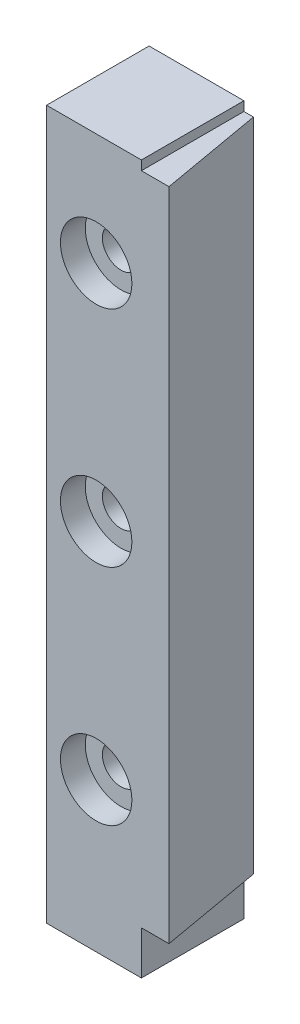
ISO-10303-21;
HEADER;
FILE_DESCRIPTION(('STEP AP214'),'2;1');
FILE_NAME('part.step','',(''),(''),'','','');
FILE_SCHEMA(('AUTOMOTIVE_DESIGN { 1 0 10303 214 1 1 1 1 }'));
ENDSEC;
DATA;
#1=APPLICATION_CONTEXT('core data for automotive mechanical design processes');
#2=APPLICATION_PROTOCOL_DEFINITION('international standard','automotive_design',2000,#1);
#3=PRODUCT_CONTEXT('',#1,'mechanical');
#4=PRODUCT('Part','Part','',(#3));
#5=PRODUCT_RELATED_PRODUCT_CATEGORY('part','',(#4));
#6=PRODUCT_DEFINITION_FORMATION('','',#4);
#7=PRODUCT_DEFINITION_CONTEXT('part definition',#1,'design');
#8=PRODUCT_DEFINITION('design','',#6,#7);
#9=PRODUCT_DEFINITION_SHAPE('','',#8);
#10=(LENGTH_UNIT() NAMED_UNIT(*) SI_UNIT(.MILLI.,.METRE.));
#11=(NAMED_UNIT(*) PLANE_ANGLE_UNIT() SI_UNIT($,.RADIAN.));
#12=(NAMED_UNIT(*) SI_UNIT($,.STERADIAN.) SOLID_ANGLE_UNIT());
#13=UNCERTAINTY_MEASURE_WITH_UNIT(LENGTH_MEASURE(1.E-05),#10,'distance_accuracy_value','');
#14=(GEOMETRIC_REPRESENTATION_CONTEXT(3) GLOBAL_UNCERTAINTY_ASSIGNED_CONTEXT((#13)) GLOBAL_UNIT_ASSIGNED_CONTEXT((#10,
#11,#12)) REPRESENTATION_CONTEXT('',''));
#15=CARTESIAN_POINT('',(0.,0.,0.));
#16=DIRECTION('',(0.,0.,1.));
#17=DIRECTION('',(1.,0.,0.));
#18=AXIS2_PLACEMENT_3D('',#15,#16,#17);
#19=CARTESIAN_POINT('',(-10.87,0.,-58.2584072114678));
#20=DIRECTION('',(1.,0.,0.));
#21=DIRECTION('',(0.,0.,-1.));
#22=AXIS2_PLACEMENT_3D('',#19,#20,#21);
#23=PLANE('',#22);
#24=DIRECTION('',(0.,1.,0.));
#25=VECTOR('',#24,1.);
#26=CARTESIAN_POINT('',(-10.87,0.,9.));
#27=LINE('',#26,#25);
#28=CARTESIAN_POINT('',(-10.87,56.25,9.));
#29=VERTEX_POINT('',#28);
#30=CARTESIAN_POINT('',(-10.87,57.,9.));
#31=VERTEX_POINT('',#30);
#32=EDGE_CURVE('E164',#29,#31,#27,.T.);
#33=ORIENTED_EDGE('',*,*,#32,.F.);
#34=DIRECTION('',(0.,0.,-1.));
#35=VECTOR('',#34,1.);
#36=CARTESIAN_POINT('',(-10.87,56.25,0.750000000000034));
#37=LINE('',#36,#35);
#38=CARTESIAN_POINT('',(-10.87,56.25,0.750000000000001));
#39=VERTEX_POINT('',#38);
#40=EDGE_CURVE('E165',#29,#39,#37,.T.);
#41=ORIENTED_EDGE('',*,*,#40,.T.);
#42=DIRECTION('',(0.,-1.,0.));
#43=VECTOR('',#42,1.);
#44=CARTESIAN_POINT('',(-10.87,0.,0.750000000000001));
#45=LINE('',#44,#43);
#46=CARTESIAN_POINT('',(-10.87,57.,0.750000000000001));
#47=VERTEX_POINT('',#46);
#48=EDGE_CURVE('E40',#47,#39,#45,.T.);
#49=ORIENTED_EDGE('',*,*,#48,.F.);
#50=DIRECTION('',(0.,0.,1.));
#51=VECTOR('',#50,1.);
#52=CARTESIAN_POINT('',(-10.87,57.,-58.2584072114678));
#53=LINE('',#52,#51);
#54=EDGE_CURVE('E149',#47,#31,#53,.T.);
#55=ORIENTED_EDGE('',*,*,#54,.T.);
#56=EDGE_LOOP('',(#33,#41,#49,#55));
#57=FACE_BOUND('',#56,.T.);
#58=ADVANCED_FACE('F32',(#57),#23,.T.);
#59=CARTESIAN_POINT('',(-10.87,3.5,0.750000000000001));
#60=VERTEX_POINT('',#59);
#61=CARTESIAN_POINT('',(-10.87,0.,0.750000000000001));
#62=VERTEX_POINT('',#61);
#63=EDGE_CURVE('E66',#60,#62,#45,.T.);
#64=ORIENTED_EDGE('',*,*,#63,.F.);
#65=DIRECTION('',(0.,0.,1.));
#66=VECTOR('',#65,1.);
#67=CARTESIAN_POINT('',(-10.87,3.5,0.750000000000001));
#68=LINE('',#67,#66);
#69=CARTESIAN_POINT('',(-10.87,3.5,9.));
#70=VERTEX_POINT('',#69);
#71=EDGE_CURVE('E126',#60,#70,#68,.T.);
#72=ORIENTED_EDGE('',*,*,#71,.T.);
#73=CARTESIAN_POINT('',(-10.87,0.,9.));
#74=VERTEX_POINT('',#73);
#75=EDGE_CURVE('E125',#74,#70,#27,.T.);
#76=ORIENTED_EDGE('',*,*,#75,.F.);
#77=DIRECTION('',(0.,0.,1.));
#78=VECTOR('',#77,1.);
#79=CARTESIAN_POINT('',(-10.87,0.,-58.2584072114678));
#80=LINE('',#79,#78);
#81=EDGE_CURVE('E77',#62,#74,#80,.T.);
#82=ORIENTED_EDGE('',*,*,#81,.F.);
#83=EDGE_LOOP('',(#64,#72,#76,#82));
#84=FACE_BOUND('',#83,.T.);
#85=ADVANCED_FACE('F251',(#84),#23,.T.);
#86=CARTESIAN_POINT('',(-18.5,0.,-58.2584072114678));
#87=DIRECTION('',(0.,-1.,0.));
#88=DIRECTION('',(1.,0.,0.));
#89=AXIS2_PLACEMENT_3D('',#86,#87,#88);
#90=PLANE('',#89);
#91=DIRECTION('',(-1.,0.,0.));
#92=VECTOR('',#91,1.);
#93=CARTESIAN_POINT('',(-18.5,0.,0.750000000000001));
#94=LINE('',#93,#92);
#95=CARTESIAN_POINT('',(-18.5,0.,0.750000000000001));
#96=VERTEX_POINT('',#95);
#97=EDGE_CURVE('E138',#62,#96,#94,.T.);
#98=ORIENTED_EDGE('',*,*,#97,.F.);
#99=ORIENTED_EDGE('',*,*,#81,.T.);
#100=DIRECTION('',(1.,0.,0.));
#101=VECTOR('',#100,1.);
#102=CARTESIAN_POINT('',(-18.5,0.,9.));
#103=LINE('',#102,#101);
#104=CARTESIAN_POINT('',(-18.5,0.,9.));
#105=VERTEX_POINT('',#104);
#106=EDGE_CURVE('E153',#105,#74,#103,.T.);
#107=ORIENTED_EDGE('',*,*,#106,.F.);
#108=DIRECTION('',(0.,0.,1.));
#109=VECTOR('',#108,1.);
#110=CARTESIAN_POINT('',(-18.5,0.,-58.2584072114678));
#111=LINE('',#110,#109);
#112=EDGE_CURVE('E155',#96,#105,#111,.T.);
#113=ORIENTED_EDGE('',*,*,#112,.F.);
#114=EDGE_LOOP('',(#98,#99,#107,#113));
#115=FACE_BOUND('',#114,.T.);
#116=ADVANCED_FACE('F256',(#115),#90,.T.);
#117=CARTESIAN_POINT('',(-18.5,57.,-58.2584072114678));
#118=DIRECTION('',(-1.,0.,0.));
#119=DIRECTION('',(0.,-1.,0.));
#120=AXIS2_PLACEMENT_3D('',#117,#118,#119);
#121=PLANE('',#120);
#122=DIRECTION('',(0.,1.,0.));
#123=VECTOR('',#122,1.);
#124=CARTESIAN_POINT('',(-18.5,57.,0.750000000000001));
#125=LINE('',#124,#123);
#126=CARTESIAN_POINT('',(-18.5,57.,0.750000000000001));
#127=VERTEX_POINT('',#126);
#128=EDGE_CURVE('E70',#96,#127,#125,.T.);
#129=ORIENTED_EDGE('',*,*,#128,.F.);
#130=ORIENTED_EDGE('',*,*,#112,.T.);
#131=DIRECTION('',(0.,-1.,0.));
#132=VECTOR('',#131,1.);
#133=CARTESIAN_POINT('',(-18.5,57.,9.));
#134=LINE('',#133,#132);
#135=CARTESIAN_POINT('',(-18.5,57.,9.));
#136=VERTEX_POINT('',#135);
#137=EDGE_CURVE('E159',#136,#105,#134,.T.);
#138=ORIENTED_EDGE('',*,*,#137,.F.);
#139=DIRECTION('',(0.,0.,1.));
#140=VECTOR('',#139,1.);
#141=CARTESIAN_POINT('',(-18.5,57.,-58.2584072114678));
#142=LINE('',#141,#140);
#143=EDGE_CURVE('E152',#127,#136,#142,.T.);
#144=ORIENTED_EDGE('',*,*,#143,.F.);
#145=EDGE_LOOP('',(#129,#130,#138,#144));
#146=FACE_BOUND('',#145,.T.);
#147=ADVANCED_FACE('F245',(#146),#121,.T.);
#148=CARTESIAN_POINT('',(-10.87,57.,-58.2584072114678));
#149=DIRECTION('',(0.,1.,0.));
#150=DIRECTION('',(-1.,0.,0.));
#151=AXIS2_PLACEMENT_3D('',#148,#149,#150);
#152=PLANE('',#151);
#153=DIRECTION('',(1.,0.,0.));
#154=VECTOR('',#153,1.);
#155=CARTESIAN_POINT('',(-10.87,57.,0.750000000000001));
#156=LINE('',#155,#154);
#157=EDGE_CURVE('E11',#127,#47,#156,.T.);
#158=ORIENTED_EDGE('',*,*,#157,.F.);
#159=ORIENTED_EDGE('',*,*,#143,.T.);
#160=DIRECTION('',(-1.,0.,0.));
#161=VECTOR('',#160,1.);
#162=CARTESIAN_POINT('',(-10.87,57.,9.));
#163=LINE('',#162,#161);
#164=EDGE_CURVE('E161',#31,#136,#163,.T.);
#165=ORIENTED_EDGE('',*,*,#164,.F.);
#166=ORIENTED_EDGE('',*,*,#54,.F.);
#167=EDGE_LOOP('',(#158,#159,#165,#166));
#168=FACE_BOUND('',#167,.T.);
#169=ADVANCED_FACE('F237',(#168),#152,.T.);
#170=CARTESIAN_POINT('',(0.,0.,9.));
#171=DIRECTION('',(0.,0.,1.));
#172=DIRECTION('',(1.,0.,0.));
#173=AXIS2_PLACEMENT_3D('',#170,#171,#172);
#174=PLANE('',#173);
#175=CARTESIAN_POINT('',(-14.5102999843588,30.,9.));
#176=DIRECTION('',(0.,0.,1.));
#177=DIRECTION('',(1.,0.,0.));
#178=AXIS2_PLACEMENT_3D('',#175,#176,#177);
#179=CIRCLE('',#178,2.875);
#180=CARTESIAN_POINT('',(-11.6352999843588,30.,9.));
#181=VERTEX_POINT('',#180);
#182=EDGE_CURVE('E197',#181,#181,#179,.T.);
#183=ORIENTED_EDGE('',*,*,#182,.F.);
#184=EDGE_LOOP('',(#183));
#185=FACE_BOUND('',#184,.T.);
#186=CARTESIAN_POINT('',(-14.5102999843588,48.,9.));
#187=DIRECTION('',(0.,0.,1.));
#188=DIRECTION('',(1.,0.,0.));
#189=AXIS2_PLACEMENT_3D('',#186,#187,#188);
#190=CIRCLE('',#189,2.875);
#191=CARTESIAN_POINT('',(-11.6352999843588,48.,9.));
#192=VERTEX_POINT('',#191);
#193=EDGE_CURVE('E191',#192,#192,#190,.T.);
#194=ORIENTED_EDGE('',*,*,#193,.F.);
#195=EDGE_LOOP('',(#194));
#196=FACE_BOUND('',#195,.T.);
#197=CARTESIAN_POINT('',(-14.5102999843588,12.,9.));
#198=DIRECTION('',(0.,0.,1.));
#199=DIRECTION('',(1.,0.,0.));
#200=AXIS2_PLACEMENT_3D('',#197,#198,#199);
#201=CIRCLE('',#200,2.875);
#202=CARTESIAN_POINT('',(-11.6352999843588,12.,9.));
#203=VERTEX_POINT('',#202);
#204=EDGE_CURVE('E185',#203,#203,#201,.T.);
#205=ORIENTED_EDGE('',*,*,#204,.F.);
#206=EDGE_LOOP('',(#205));
#207=FACE_BOUND('',#206,.T.);
#208=ORIENTED_EDGE('',*,*,#75,.T.);
#209=DIRECTION('',(1.,0.,0.));
#210=VECTOR('',#209,1.);
#211=CARTESIAN_POINT('',(-10.87,3.5,9.));
#212=LINE('',#211,#210);
#213=CARTESIAN_POINT('',(-8.65081193809254,3.5,9.));
#214=VERTEX_POINT('',#213);
#215=EDGE_CURVE('E48',#70,#214,#212,.T.);
#216=ORIENTED_EDGE('',*,*,#215,.T.);
#217=DIRECTION('',(0.,-1.,0.));
#218=VECTOR('',#217,1.);
#219=CARTESIAN_POINT('',(-8.65081193809254,64.7932602473595,9.));
#220=LINE('',#219,#218);
#221=CARTESIAN_POINT('',(-8.65081193809254,56.25,9.));
#222=VERTEX_POINT('',#221);
#223=EDGE_CURVE('E111',#222,#214,#220,.T.);
#224=ORIENTED_EDGE('',*,*,#223,.F.);
#225=DIRECTION('',(-1.,0.,0.));
#226=VECTOR('',#225,1.);
#227=CARTESIAN_POINT('',(-10.87,56.25,9.));
#228=LINE('',#227,#226);
#229=EDGE_CURVE('E180',#222,#29,#228,.T.);
#230=ORIENTED_EDGE('',*,*,#229,.T.);
#231=ORIENTED_EDGE('',*,*,#32,.T.);
#232=ORIENTED_EDGE('',*,*,#164,.T.);
#233=ORIENTED_EDGE('',*,*,#137,.T.);
#234=ORIENTED_EDGE('',*,*,#106,.T.);
#235=EDGE_LOOP('',(#208,#216,#224,#230,#231,#232,#233,#234));
#236=FACE_BOUND('',#235,.T.);
#237=ADVANCED_FACE('F123',(#185,#196,#207,#236),#174,.T.);
#238=CARTESIAN_POINT('',(-58.,100.,0.749999999999999));
#239=DIRECTION('',(0.,0.,1.));
#240=DIRECTION('',(1.,0.,0.));
#241=AXIS2_PLACEMENT_3D('',#238,#239,#240);
#242=PLANE('',#241);
#243=CARTESIAN_POINT('',(-14.5102999843588,12.,0.750000000000001));
#244=DIRECTION('',(0.,0.,1.));
#245=DIRECTION('',(1.,0.,0.));
#246=AXIS2_PLACEMENT_3D('',#243,#244,#245);
#247=CIRCLE('',#246,1.5);
#248=CARTESIAN_POINT('',(-13.0102999843588,12.,0.750000000000001));
#249=VERTEX_POINT('',#248);
#250=EDGE_CURVE('E210',#249,#249,#247,.T.);
#251=ORIENTED_EDGE('',*,*,#250,.T.);
#252=EDGE_LOOP('',(#251));
#253=FACE_BOUND('',#252,.T.);
#254=CARTESIAN_POINT('',(-14.5102999843588,30.,0.750000000000001));
#255=DIRECTION('',(0.,0.,1.));
#256=DIRECTION('',(1.,0.,0.));
#257=AXIS2_PLACEMENT_3D('',#254,#255,#256);
#258=CIRCLE('',#257,1.5);
#259=CARTESIAN_POINT('',(-13.0102999843588,30.,0.750000000000001));
#260=VERTEX_POINT('',#259);
#261=EDGE_CURVE('E206',#260,#260,#258,.T.);
#262=ORIENTED_EDGE('',*,*,#261,.T.);
#263=EDGE_LOOP('',(#262));
#264=FACE_BOUND('',#263,.T.);
#265=CARTESIAN_POINT('',(-14.5102999843588,48.,0.750000000000001));
#266=DIRECTION('',(0.,0.,1.));
#267=DIRECTION('',(1.,0.,0.));
#268=AXIS2_PLACEMENT_3D('',#265,#266,#267);
#269=CIRCLE('',#268,1.5);
#270=CARTESIAN_POINT('',(-13.0102999843588,48.,0.750000000000001));
#271=VERTEX_POINT('',#270);
#272=EDGE_CURVE('E200',#271,#271,#269,.T.);
#273=ORIENTED_EDGE('',*,*,#272,.T.);
#274=EDGE_LOOP('',(#273));
#275=FACE_BOUND('',#274,.T.);
#276=ORIENTED_EDGE('',*,*,#48,.T.);
#277=DIRECTION('',(1.,0.,0.));
#278=VECTOR('',#277,1.);
#279=CARTESIAN_POINT('',(-10.1055095289373,56.25,0.750000000000001));
#280=LINE('',#279,#278);
#281=CARTESIAN_POINT('',(-10.1055095289373,56.25,0.750000000000001));
#282=VERTEX_POINT('',#281);
#283=EDGE_CURVE('E119',#39,#282,#280,.T.);
#284=ORIENTED_EDGE('',*,*,#283,.T.);
#285=DIRECTION('',(0.,-1.,0.));
#286=VECTOR('',#285,1.);
#287=CARTESIAN_POINT('',(-10.1055095289373,64.7932602473595,0.750000000000001));
#288=LINE('',#287,#286);
#289=CARTESIAN_POINT('',(-10.1055095289373,3.5,0.750000000000001));
#290=VERTEX_POINT('',#289);
#291=EDGE_CURVE('E120',#282,#290,#288,.T.);
#292=ORIENTED_EDGE('',*,*,#291,.T.);
#293=DIRECTION('',(-1.,0.,0.));
#294=VECTOR('',#293,1.);
#295=CARTESIAN_POINT('',(-10.1055095289373,3.5,0.750000000000001));
#296=LINE('',#295,#294);
#297=EDGE_CURVE('E129',#290,#60,#296,.T.);
#298=ORIENTED_EDGE('',*,*,#297,.T.);
#299=ORIENTED_EDGE('',*,*,#63,.T.);
#300=ORIENTED_EDGE('',*,*,#97,.T.);
#301=ORIENTED_EDGE('',*,*,#128,.T.);
#302=ORIENTED_EDGE('',*,*,#157,.T.);
#303=EDGE_LOOP('',(#276,#284,#292,#298,#299,#300,#301,#302));
#304=FACE_BOUND('',#303,.T.);
#305=ADVANCED_FACE('F236',(#253,#264,#275,#304),#242,.F.);
#306=CARTESIAN_POINT('',(0.,3.5,0.));
#307=DIRECTION('',(0.,1.,0.));
#308=DIRECTION('',(0.,0.,1.));
#309=AXIS2_PLACEMENT_3D('',#306,#307,#308);
#310=PLANE('',#309);
#311=ORIENTED_EDGE('',*,*,#71,.F.);
#312=ORIENTED_EDGE('',*,*,#297,.F.);
#313=DIRECTION('',(-0.173648177666924,0.,-0.984807753012209));
#314=VECTOR('',#313,1.);
#315=CARTESIAN_POINT('',(-8.65081193809254,3.5,9.));
#316=LINE('',#315,#314);
#317=EDGE_CURVE('E114',#214,#290,#316,.T.);
#318=ORIENTED_EDGE('',*,*,#317,.F.);
#319=ORIENTED_EDGE('',*,*,#215,.F.);
#320=EDGE_LOOP('',(#311,#312,#318,#319));
#321=FACE_BOUND('',#320,.T.);
#322=ADVANCED_FACE('F128',(#321),#310,.F.);
#323=CARTESIAN_POINT('',(-8.65081193809254,64.7932602473595,9.));
#324=DIRECTION('',(-0.984807753012209,0.,0.173648177666924));
#325=DIRECTION('',(0.173648177666924,0.,0.984807753012209));
#326=AXIS2_PLACEMENT_3D('',#323,#324,#325);
#327=PLANE('',#326);
#328=ORIENTED_EDGE('',*,*,#291,.F.);
#329=DIRECTION('',(0.173648177666924,0.,0.984807753012209));
#330=VECTOR('',#329,1.);
#331=CARTESIAN_POINT('',(-8.65081193809253,56.25,9.00000000000003));
#332=LINE('',#331,#330);
#333=EDGE_CURVE('E116',#282,#222,#332,.T.);
#334=ORIENTED_EDGE('',*,*,#333,.T.);
#335=ORIENTED_EDGE('',*,*,#223,.T.);
#336=ORIENTED_EDGE('',*,*,#317,.T.);
#337=EDGE_LOOP('',(#328,#334,#335,#336));
#338=FACE_BOUND('',#337,.T.);
#339=ADVANCED_FACE('F113',(#338),#327,.F.);
#340=CARTESIAN_POINT('',(-65.243149171521,56.25,-3.99999999999997));
#341=DIRECTION('',(0.,-1.,0.));
#342=DIRECTION('',(0.,0.,-1.));
#343=AXIS2_PLACEMENT_3D('',#340,#341,#342);
#344=PLANE('',#343);
#345=ORIENTED_EDGE('',*,*,#229,.F.);
#346=ORIENTED_EDGE('',*,*,#333,.F.);
#347=ORIENTED_EDGE('',*,*,#283,.F.);
#348=ORIENTED_EDGE('',*,*,#40,.F.);
#349=EDGE_LOOP('',(#345,#346,#347,#348));
#350=FACE_BOUND('',#349,.T.);
#351=ADVANCED_FACE('F231',(#350),#344,.F.);
#352=CARTESIAN_POINT('',(-14.5102999843588,12.,7.));
#353=DIRECTION('',(0.,0.,1.));
#354=DIRECTION('',(1.,0.,0.));
#355=AXIS2_PLACEMENT_3D('',#352,#353,#354);
#356=CYLINDRICAL_SURFACE('',#355,2.875);
#357=CARTESIAN_POINT('',(-14.5102999843588,12.,7.));
#358=DIRECTION('',(0.,0.,1.));
#359=DIRECTION('',(1.,0.,0.));
#360=AXIS2_PLACEMENT_3D('',#357,#358,#359);
#361=CIRCLE('',#360,2.875);
#362=CARTESIAN_POINT('',(-11.6352999843588,12.,7.));
#363=VERTEX_POINT('',#362);
#364=EDGE_CURVE('E168',#363,#363,#361,.T.);
#365=ORIENTED_EDGE('',*,*,#364,.F.);
#366=EDGE_LOOP('',(#365));
#367=FACE_BOUND('',#366,.T.);
#368=ORIENTED_EDGE('',*,*,#204,.T.);
#369=EDGE_LOOP('',(#368));
#370=FACE_BOUND('',#369,.T.);
#371=ADVANCED_FACE('F225',(#367,#370),#356,.F.);
#372=CARTESIAN_POINT('',(-14.5102999843588,12.,7.));
#373=DIRECTION('',(0.,0.,1.));
#374=DIRECTION('',(1.,0.,0.));
#375=AXIS2_PLACEMENT_3D('',#372,#373,#374);
#376=PLANE('',#375);
#377=CARTESIAN_POINT('',(-14.5102999843588,12.,7.));
#378=DIRECTION('',(0.,0.,1.));
#379=DIRECTION('',(1.,0.,0.));
#380=AXIS2_PLACEMENT_3D('',#377,#378,#379);
#381=CIRCLE('',#380,1.5);
#382=CARTESIAN_POINT('',(-13.0102999843588,12.,7.));
#383=VERTEX_POINT('',#382);
#384=EDGE_CURVE('E35',#383,#383,#381,.T.);
#385=ORIENTED_EDGE('',*,*,#384,.F.);
#386=EDGE_LOOP('',(#385));
#387=FACE_BOUND('',#386,.T.);
#388=ORIENTED_EDGE('',*,*,#364,.T.);
#389=EDGE_LOOP('',(#388));
#390=FACE_BOUND('',#389,.T.);
#391=ADVANCED_FACE('F221',(#387,#390),#376,.T.);
#392=CARTESIAN_POINT('',(-14.5102999843588,48.,7.));
#393=DIRECTION('',(0.,0.,1.));
#394=DIRECTION('',(1.,0.,0.));
#395=AXIS2_PLACEMENT_3D('',#392,#393,#394);
#396=CYLINDRICAL_SURFACE('',#395,2.875);
#397=CARTESIAN_POINT('',(-14.5102999843588,48.,7.));
#398=DIRECTION('',(0.,0.,1.));
#399=DIRECTION('',(1.,0.,0.));
#400=AXIS2_PLACEMENT_3D('',#397,#398,#399);
#401=CIRCLE('',#400,2.875);
#402=CARTESIAN_POINT('',(-11.6352999843588,48.,7.));
#403=VERTEX_POINT('',#402);
#404=EDGE_CURVE('E188',#403,#403,#401,.T.);
#405=ORIENTED_EDGE('',*,*,#404,.F.);
#406=EDGE_LOOP('',(#405));
#407=FACE_BOUND('',#406,.T.);
#408=ORIENTED_EDGE('',*,*,#193,.T.);
#409=EDGE_LOOP('',(#408));
#410=FACE_BOUND('',#409,.T.);
#411=ADVANCED_FACE('F224',(#407,#410),#396,.F.);
#412=CARTESIAN_POINT('',(-14.5102999843588,48.,7.));
#413=DIRECTION('',(0.,0.,1.));
#414=DIRECTION('',(1.,0.,0.));
#415=AXIS2_PLACEMENT_3D('',#412,#413,#414);
#416=PLANE('',#415);
#417=CARTESIAN_POINT('',(-14.5102999843588,48.,7.));
#418=DIRECTION('',(0.,0.,1.));
#419=DIRECTION('',(1.,0.,0.));
#420=AXIS2_PLACEMENT_3D('',#417,#418,#419);
#421=CIRCLE('',#420,1.5);
#422=CARTESIAN_POINT('',(-13.0102999843588,48.,7.));
#423=VERTEX_POINT('',#422);
#424=EDGE_CURVE('E205',#423,#423,#421,.T.);
#425=ORIENTED_EDGE('',*,*,#424,.F.);
#426=EDGE_LOOP('',(#425));
#427=FACE_BOUND('',#426,.T.);
#428=ORIENTED_EDGE('',*,*,#404,.T.);
#429=EDGE_LOOP('',(#428));
#430=FACE_BOUND('',#429,.T.);
#431=ADVANCED_FACE('F339',(#427,#430),#416,.T.);
#432=CARTESIAN_POINT('',(-14.5102999843588,30.,7.));
#433=DIRECTION('',(0.,0.,1.));
#434=DIRECTION('',(1.,0.,0.));
#435=AXIS2_PLACEMENT_3D('',#432,#433,#434);
#436=CYLINDRICAL_SURFACE('',#435,2.875);
#437=CARTESIAN_POINT('',(-14.5102999843588,30.,7.));
#438=DIRECTION('',(0.,0.,1.));
#439=DIRECTION('',(1.,0.,0.));
#440=AXIS2_PLACEMENT_3D('',#437,#438,#439);
#441=CIRCLE('',#440,2.875);
#442=CARTESIAN_POINT('',(-11.6352999843588,30.,7.));
#443=VERTEX_POINT('',#442);
#444=EDGE_CURVE('E194',#443,#443,#441,.T.);
#445=ORIENTED_EDGE('',*,*,#444,.F.);
#446=EDGE_LOOP('',(#445));
#447=FACE_BOUND('',#446,.T.);
#448=ORIENTED_EDGE('',*,*,#182,.T.);
#449=EDGE_LOOP('',(#448));
#450=FACE_BOUND('',#449,.T.);
#451=ADVANCED_FACE('F350',(#447,#450),#436,.F.);
#452=CARTESIAN_POINT('',(-14.5102999843588,30.,7.));
#453=DIRECTION('',(0.,0.,1.));
#454=DIRECTION('',(1.,0.,0.));
#455=AXIS2_PLACEMENT_3D('',#452,#453,#454);
#456=PLANE('',#455);
#457=CARTESIAN_POINT('',(-14.5102999843588,30.,7.));
#458=DIRECTION('',(0.,0.,1.));
#459=DIRECTION('',(1.,0.,0.));
#460=AXIS2_PLACEMENT_3D('',#457,#458,#459);
#461=CIRCLE('',#460,1.5);
#462=CARTESIAN_POINT('',(-13.0102999843588,30.,7.));
#463=VERTEX_POINT('',#462);
#464=EDGE_CURVE('E209',#463,#463,#461,.T.);
#465=ORIENTED_EDGE('',*,*,#464,.F.);
#466=EDGE_LOOP('',(#465));
#467=FACE_BOUND('',#466,.T.);
#468=ORIENTED_EDGE('',*,*,#444,.T.);
#469=EDGE_LOOP('',(#468));
#470=FACE_BOUND('',#469,.T.);
#471=ADVANCED_FACE('F360',(#467,#470),#456,.T.);
#472=CARTESIAN_POINT('',(-14.5102999843588,48.,30.));
#473=DIRECTION('',(0.,0.,-1.));
#474=DIRECTION('',(-1.,0.,0.));
#475=AXIS2_PLACEMENT_3D('',#472,#473,#474);
#476=CYLINDRICAL_SURFACE('',#475,1.5);
#477=ORIENTED_EDGE('',*,*,#424,.T.);
#478=EDGE_LOOP('',(#477));
#479=FACE_BOUND('',#478,.T.);
#480=ORIENTED_EDGE('',*,*,#272,.F.);
#481=EDGE_LOOP('',(#480));
#482=FACE_BOUND('',#481,.T.);
#483=ADVANCED_FACE('F369',(#479,#482),#476,.F.);
#484=CARTESIAN_POINT('',(-14.5102999843588,30.,30.));
#485=DIRECTION('',(0.,0.,-1.));
#486=DIRECTION('',(-1.,0.,0.));
#487=AXIS2_PLACEMENT_3D('',#484,#485,#486);
#488=CYLINDRICAL_SURFACE('',#487,1.5);
#489=ORIENTED_EDGE('',*,*,#464,.T.);
#490=EDGE_LOOP('',(#489));
#491=FACE_BOUND('',#490,.T.);
#492=ORIENTED_EDGE('',*,*,#261,.F.);
#493=EDGE_LOOP('',(#492));
#494=FACE_BOUND('',#493,.T.);
#495=ADVANCED_FACE('F379',(#491,#494),#488,.F.);
#496=CARTESIAN_POINT('',(-14.5102999843588,12.,30.));
#497=DIRECTION('',(0.,0.,-1.));
#498=DIRECTION('',(-1.,0.,0.));
#499=AXIS2_PLACEMENT_3D('',#496,#497,#498);
#500=CYLINDRICAL_SURFACE('',#499,1.5);
#501=ORIENTED_EDGE('',*,*,#384,.T.);
#502=EDGE_LOOP('',(#501));
#503=FACE_BOUND('',#502,.T.);
#504=ORIENTED_EDGE('',*,*,#250,.F.);
#505=EDGE_LOOP('',(#504));
#506=FACE_BOUND('',#505,.T.);
#507=ADVANCED_FACE('F218',(#503,#506),#500,.F.);
#508=CLOSED_SHELL('',(#58,#85,#116,#147,#169,#237,#305,#322,#339,#351,#371,#391,#411,#431,#451,
#471,#483,#495,#507));
#509=MANIFOLD_SOLID_BREP('B2',#508);
#510=ADVANCED_BREP_SHAPE_REPRESENTATION('',(#18,#509),#14);
#511=SHAPE_DEFINITION_REPRESENTATION(#9,#510);
ENDSEC;
END-ISO-10303-21;
